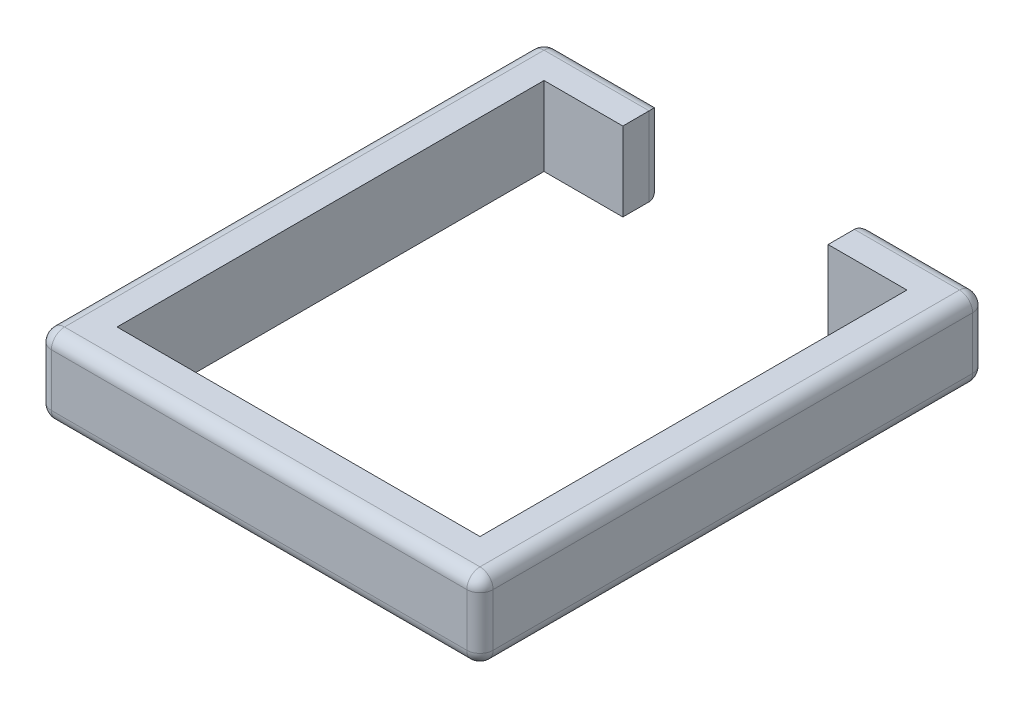
ISO-10303-21;
HEADER;
FILE_DESCRIPTION(('STEP AP214'),'2;1');
FILE_NAME('part.step','',(''),(''),'','','');
FILE_SCHEMA(('AUTOMOTIVE_DESIGN { 1 0 10303 214 1 1 1 1 }'));
ENDSEC;
DATA;
#1=APPLICATION_CONTEXT('core data for automotive mechanical design processes');
#2=APPLICATION_PROTOCOL_DEFINITION('international standard','automotive_design',2000,#1);
#3=PRODUCT_CONTEXT('',#1,'mechanical');
#4=PRODUCT('Part','Part','',(#3));
#5=PRODUCT_RELATED_PRODUCT_CATEGORY('part','',(#4));
#6=PRODUCT_DEFINITION_FORMATION('','',#4);
#7=PRODUCT_DEFINITION_CONTEXT('part definition',#1,'design');
#8=PRODUCT_DEFINITION('design','',#6,#7);
#9=PRODUCT_DEFINITION_SHAPE('','',#8);
#10=(LENGTH_UNIT() NAMED_UNIT(*) SI_UNIT(.MILLI.,.METRE.));
#11=(NAMED_UNIT(*) PLANE_ANGLE_UNIT() SI_UNIT($,.RADIAN.));
#12=(NAMED_UNIT(*) SI_UNIT($,.STERADIAN.) SOLID_ANGLE_UNIT());
#13=UNCERTAINTY_MEASURE_WITH_UNIT(LENGTH_MEASURE(1.E-05),#10,'distance_accuracy_value','');
#14=(GEOMETRIC_REPRESENTATION_CONTEXT(3) GLOBAL_UNCERTAINTY_ASSIGNED_CONTEXT((#13)) GLOBAL_UNIT_ASSIGNED_CONTEXT((#10,
#11,#12)) REPRESENTATION_CONTEXT('',''));
#15=CARTESIAN_POINT('',(0.,0.,0.));
#16=DIRECTION('',(0.,0.,1.));
#17=DIRECTION('',(1.,0.,0.));
#18=AXIS2_PLACEMENT_3D('',#15,#16,#17);
#19=CARTESIAN_POINT('',(228.6,152.4,76.2));
#20=DIRECTION('',(-1.,0.,0.));
#21=DIRECTION('',(0.,0.,1.));
#22=AXIS2_PLACEMENT_3D('',#19,#20,#21);
#23=PLANE('',#22);
#24=DIRECTION('',(0.,0.,-1.));
#25=VECTOR('',#24,1.);
#26=CARTESIAN_POINT('',(228.6,0.,76.2));
#27=LINE('',#26,#25);
#28=CARTESIAN_POINT('',(228.6,0.,76.2));
#29=VERTEX_POINT('',#28);
#30=CARTESIAN_POINT('',(228.6,0.,25.4));
#31=VERTEX_POINT('',#30);
#32=EDGE_CURVE('E221',#29,#31,#27,.T.);
#33=ORIENTED_EDGE('',*,*,#32,.T.);
#34=DIRECTION('',(0.,-1.,0.));
#35=VECTOR('',#34,1.);
#36=CARTESIAN_POINT('',(228.6,152.4,25.4));
#37=LINE('',#36,#35);
#38=CARTESIAN_POINT('',(228.6,152.4,25.4));
#39=VERTEX_POINT('',#38);
#40=EDGE_CURVE('E295',#31,#39,#37,.F.);
#41=ORIENTED_EDGE('',*,*,#40,.T.);
#42=DIRECTION('',(0.,0.,-1.));
#43=VECTOR('',#42,1.);
#44=CARTESIAN_POINT('',(228.6,152.4,76.2));
#45=LINE('',#44,#43);
#46=CARTESIAN_POINT('',(228.6,152.4,76.2));
#47=VERTEX_POINT('',#46);
#48=EDGE_CURVE('E194',#47,#39,#45,.T.);
#49=ORIENTED_EDGE('',*,*,#48,.F.);
#50=DIRECTION('',(0.,-1.,0.));
#51=VECTOR('',#50,1.);
#52=CARTESIAN_POINT('',(228.6,152.4,76.2));
#53=LINE('',#52,#51);
#54=EDGE_CURVE('E220',#47,#29,#53,.T.);
#55=ORIENTED_EDGE('',*,*,#54,.T.);
#56=EDGE_LOOP('',(#33,#41,#49,#55));
#57=FACE_BOUND('',#56,.T.);
#58=ADVANCED_FACE('F35',(#57),#23,.F.);
#59=CARTESIAN_POINT('',(228.6,152.4,0.));
#60=DIRECTION('',(0.,0.,1.));
#61=DIRECTION('',(1.,0.,0.));
#62=AXIS2_PLACEMENT_3D('',#59,#60,#61);
#63=PLANE('',#62);
#64=DIRECTION('',(-1.,0.,0.));
#65=VECTOR('',#64,1.);
#66=CARTESIAN_POINT('',(228.6,127.,0.));
#67=LINE('',#66,#65);
#68=CARTESIAN_POINT('',(25.4,127.,0.));
#69=VERTEX_POINT('',#68);
#70=CARTESIAN_POINT('',(203.2,127.,0.));
#71=VERTEX_POINT('',#70);
#72=EDGE_CURVE('E290',#69,#71,#67,.F.);
#73=ORIENTED_EDGE('',*,*,#72,.T.);
#74=DIRECTION('',(0.,-1.,0.));
#75=VECTOR('',#74,1.);
#76=CARTESIAN_POINT('',(203.2,152.4,0.));
#77=LINE('',#76,#75);
#78=CARTESIAN_POINT('',(203.2,25.4,0.));
#79=VERTEX_POINT('',#78);
#80=EDGE_CURVE('E292',#71,#79,#77,.T.);
#81=ORIENTED_EDGE('',*,*,#80,.T.);
#82=DIRECTION('',(-1.,0.,0.));
#83=VECTOR('',#82,1.);
#84=CARTESIAN_POINT('',(228.6,25.4,0.));
#85=LINE('',#84,#83);
#86=CARTESIAN_POINT('',(25.4,25.4,0.));
#87=VERTEX_POINT('',#86);
#88=EDGE_CURVE('E288',#79,#87,#85,.T.);
#89=ORIENTED_EDGE('',*,*,#88,.T.);
#90=DIRECTION('',(0.,-1.,0.));
#91=VECTOR('',#90,1.);
#92=CARTESIAN_POINT('',(25.4,152.4,0.));
#93=LINE('',#92,#91);
#94=EDGE_CURVE('E286',#87,#69,#93,.F.);
#95=ORIENTED_EDGE('',*,*,#94,.T.);
#96=EDGE_LOOP('',(#73,#81,#89,#95));
#97=FACE_BOUND('',#96,.T.);
#98=ADVANCED_FACE('F430',(#97),#63,.F.);
#99=CARTESIAN_POINT('',(0.,152.4,0.));
#100=DIRECTION('',(1.,0.,0.));
#101=DIRECTION('',(0.,0.,-1.));
#102=AXIS2_PLACEMENT_3D('',#99,#100,#101);
#103=PLANE('',#102);
#104=DIRECTION('',(0.,0.,1.));
#105=VECTOR('',#104,1.);
#106=CARTESIAN_POINT('',(0.,127.,0.));
#107=LINE('',#106,#105);
#108=CARTESIAN_POINT('',(1.16647607618785E-13,127.,952.5));
#109=VERTEX_POINT('',#108);
#110=CARTESIAN_POINT('',(0.,127.,25.4));
#111=VERTEX_POINT('',#110);
#112=EDGE_CURVE('E301',#109,#111,#107,.F.);
#113=ORIENTED_EDGE('',*,*,#112,.T.);
#114=DIRECTION('',(0.,-1.,0.));
#115=VECTOR('',#114,1.);
#116=CARTESIAN_POINT('',(0.,152.4,25.4));
#117=LINE('',#116,#115);
#118=CARTESIAN_POINT('',(0.,25.4,25.4));
#119=VERTEX_POINT('',#118);
#120=EDGE_CURVE('E303',#111,#119,#117,.T.);
#121=ORIENTED_EDGE('',*,*,#120,.T.);
#122=DIRECTION('',(0.,0.,1.));
#123=VECTOR('',#122,1.);
#124=CARTESIAN_POINT('',(0.,25.4,0.));
#125=LINE('',#124,#123);
#126=CARTESIAN_POINT('',(1.16647607618785E-13,25.4,952.5));
#127=VERTEX_POINT('',#126);
#128=EDGE_CURVE('E297',#119,#127,#125,.T.);
#129=ORIENTED_EDGE('',*,*,#128,.T.);
#130=DIRECTION('',(0.,-1.,0.));
#131=VECTOR('',#130,1.);
#132=CARTESIAN_POINT('',(1.16647607618785E-13,152.4,952.5));
#133=LINE('',#132,#131);
#134=EDGE_CURVE('E299',#127,#109,#133,.F.);
#135=ORIENTED_EDGE('',*,*,#134,.T.);
#136=EDGE_LOOP('',(#113,#121,#129,#135));
#137=FACE_BOUND('',#136,.T.);
#138=ADVANCED_FACE('F405',(#137),#103,.F.);
#139=CARTESIAN_POINT('',(1.1975821048862E-13,152.4,977.9));
#140=DIRECTION('',(0.,0.,-1.));
#141=DIRECTION('',(-1.,0.,0.));
#142=AXIS2_PLACEMENT_3D('',#139,#140,#141);
#143=PLANE('',#142);
#144=DIRECTION('',(1.,0.,0.));
#145=VECTOR('',#144,1.);
#146=CARTESIAN_POINT('',(1.1975821048862E-13,127.,977.9));
#147=LINE('',#146,#145);
#148=CARTESIAN_POINT('',(828.675,127.,977.9));
#149=VERTEX_POINT('',#148);
#150=CARTESIAN_POINT('',(25.4000000000001,127.,977.9));
#151=VERTEX_POINT('',#150);
#152=EDGE_CURVE('E260',#149,#151,#147,.F.);
#153=ORIENTED_EDGE('',*,*,#152,.T.);
#154=DIRECTION('',(0.,-1.,0.));
#155=VECTOR('',#154,1.);
#156=CARTESIAN_POINT('',(25.4000000000001,152.4,977.9));
#157=LINE('',#156,#155);
#158=CARTESIAN_POINT('',(25.4000000000001,25.4,977.9));
#159=VERTEX_POINT('',#158);
#160=EDGE_CURVE('E263',#151,#159,#157,.T.);
#161=ORIENTED_EDGE('',*,*,#160,.T.);
#162=DIRECTION('',(1.,0.,0.));
#163=VECTOR('',#162,1.);
#164=CARTESIAN_POINT('',(1.1975821048862E-13,25.4,977.9));
#165=LINE('',#164,#163);
#166=CARTESIAN_POINT('',(828.675,25.4,977.9));
#167=VERTEX_POINT('',#166);
#168=EDGE_CURVE('E258',#159,#167,#165,.T.);
#169=ORIENTED_EDGE('',*,*,#168,.T.);
#170=DIRECTION('',(0.,-1.,0.));
#171=VECTOR('',#170,1.);
#172=CARTESIAN_POINT('',(828.675,152.4,977.9));
#173=LINE('',#172,#171);
#174=EDGE_CURVE('E256',#167,#149,#173,.F.);
#175=ORIENTED_EDGE('',*,*,#174,.T.);
#176=EDGE_LOOP('',(#153,#161,#169,#175));
#177=FACE_BOUND('',#176,.T.);
#178=ADVANCED_FACE('F457',(#177),#143,.F.);
#179=CARTESIAN_POINT('',(854.075,152.4,977.9));
#180=DIRECTION('',(-1.,0.,0.));
#181=DIRECTION('',(0.,0.,1.));
#182=AXIS2_PLACEMENT_3D('',#179,#180,#181);
#183=PLANE('',#182);
#184=DIRECTION('',(0.,0.,-1.));
#185=VECTOR('',#184,1.);
#186=CARTESIAN_POINT('',(854.075,127.,977.9));
#187=LINE('',#186,#185);
#188=CARTESIAN_POINT('',(854.075,127.,25.4));
#189=VERTEX_POINT('',#188);
#190=CARTESIAN_POINT('',(854.075,127.,952.5));
#191=VERTEX_POINT('',#190);
#192=EDGE_CURVE('E44',#189,#191,#187,.F.);
#193=ORIENTED_EDGE('',*,*,#192,.T.);
#194=DIRECTION('',(0.,-1.,0.));
#195=VECTOR('',#194,1.);
#196=CARTESIAN_POINT('',(854.075,152.4,952.5));
#197=LINE('',#196,#195);
#198=CARTESIAN_POINT('',(854.075,25.4,952.5));
#199=VERTEX_POINT('',#198);
#200=EDGE_CURVE('E11',#191,#199,#197,.T.);
#201=ORIENTED_EDGE('',*,*,#200,.T.);
#202=DIRECTION('',(0.,0.,-1.));
#203=VECTOR('',#202,1.);
#204=CARTESIAN_POINT('',(854.075,25.4,977.9));
#205=LINE('',#204,#203);
#206=CARTESIAN_POINT('',(854.075,25.4,25.4));
#207=VERTEX_POINT('',#206);
#208=EDGE_CURVE('E306',#199,#207,#205,.T.);
#209=ORIENTED_EDGE('',*,*,#208,.T.);
#210=DIRECTION('',(0.,-1.,0.));
#211=VECTOR('',#210,1.);
#212=CARTESIAN_POINT('',(854.075,152.4,25.4));
#213=LINE('',#212,#211);
#214=EDGE_CURVE('E55',#207,#189,#213,.F.);
#215=ORIENTED_EDGE('',*,*,#214,.T.);
#216=EDGE_LOOP('',(#193,#201,#209,#215));
#217=FACE_BOUND('',#216,.T.);
#218=ADVANCED_FACE('F763',(#217),#183,.F.);
#219=CARTESIAN_POINT('',(854.075,152.4,0.));
#220=DIRECTION('',(0.,0.,1.));
#221=DIRECTION('',(1.,0.,0.));
#222=AXIS2_PLACEMENT_3D('',#219,#220,#221);
#223=PLANE('',#222);
#224=DIRECTION('',(0.,-1.,0.));
#225=VECTOR('',#224,1.);
#226=CARTESIAN_POINT('',(650.875,152.4,0.));
#227=LINE('',#226,#225);
#228=CARTESIAN_POINT('',(650.875,25.4,0.));
#229=VERTEX_POINT('',#228);
#230=CARTESIAN_POINT('',(650.875,127.,0.));
#231=VERTEX_POINT('',#230);
#232=EDGE_CURVE('E279',#229,#231,#227,.F.);
#233=ORIENTED_EDGE('',*,*,#232,.T.);
#234=DIRECTION('',(-1.,0.,0.));
#235=VECTOR('',#234,1.);
#236=CARTESIAN_POINT('',(854.075,127.,0.));
#237=LINE('',#236,#235);
#238=CARTESIAN_POINT('',(828.675,127.,0.));
#239=VERTEX_POINT('',#238);
#240=EDGE_CURVE('E281',#231,#239,#237,.F.);
#241=ORIENTED_EDGE('',*,*,#240,.T.);
#242=DIRECTION('',(0.,-1.,0.));
#243=VECTOR('',#242,1.);
#244=CARTESIAN_POINT('',(828.675,152.4,0.));
#245=LINE('',#244,#243);
#246=CARTESIAN_POINT('',(828.675,25.4,0.));
#247=VERTEX_POINT('',#246);
#248=EDGE_CURVE('E275',#239,#247,#245,.T.);
#249=ORIENTED_EDGE('',*,*,#248,.T.);
#250=DIRECTION('',(-1.,0.,0.));
#251=VECTOR('',#250,1.);
#252=CARTESIAN_POINT('',(854.075,25.4,0.));
#253=LINE('',#252,#251);
#254=EDGE_CURVE('E277',#247,#229,#253,.T.);
#255=ORIENTED_EDGE('',*,*,#254,.T.);
#256=EDGE_LOOP('',(#233,#241,#249,#255));
#257=FACE_BOUND('',#256,.T.);
#258=ADVANCED_FACE('F488',(#257),#223,.F.);
#259=CARTESIAN_POINT('',(625.475,152.4,0.));
#260=DIRECTION('',(1.,0.,0.));
#261=DIRECTION('',(0.,0.,-1.));
#262=AXIS2_PLACEMENT_3D('',#259,#260,#261);
#263=PLANE('',#262);
#264=DIRECTION('',(0.,0.,1.));
#265=VECTOR('',#264,1.);
#266=CARTESIAN_POINT('',(625.475,152.4,0.));
#267=LINE('',#266,#265);
#268=CARTESIAN_POINT('',(625.475,152.4,25.4));
#269=VERTEX_POINT('',#268);
#270=CARTESIAN_POINT('',(625.475,152.4,76.2));
#271=VERTEX_POINT('',#270);
#272=EDGE_CURVE('E183',#269,#271,#267,.T.);
#273=ORIENTED_EDGE('',*,*,#272,.F.);
#274=DIRECTION('',(0.,-1.,0.));
#275=VECTOR('',#274,1.);
#276=CARTESIAN_POINT('',(625.475,152.4,25.4));
#277=LINE('',#276,#275);
#278=CARTESIAN_POINT('',(625.475,0.,25.4));
#279=VERTEX_POINT('',#278);
#280=EDGE_CURVE('E284',#269,#279,#277,.T.);
#281=ORIENTED_EDGE('',*,*,#280,.T.);
#282=DIRECTION('',(0.,0.,1.));
#283=VECTOR('',#282,1.);
#284=CARTESIAN_POINT('',(625.475,0.,0.));
#285=LINE('',#284,#283);
#286=CARTESIAN_POINT('',(625.475,0.,76.2));
#287=VERTEX_POINT('',#286);
#288=EDGE_CURVE('E200',#279,#287,#285,.T.);
#289=ORIENTED_EDGE('',*,*,#288,.T.);
#290=DIRECTION('',(0.,-1.,0.));
#291=VECTOR('',#290,1.);
#292=CARTESIAN_POINT('',(625.475,152.4,76.2));
#293=LINE('',#292,#291);
#294=EDGE_CURVE('E197',#271,#287,#293,.T.);
#295=ORIENTED_EDGE('',*,*,#294,.F.);
#296=EDGE_LOOP('',(#273,#281,#289,#295));
#297=FACE_BOUND('',#296,.T.);
#298=ADVANCED_FACE('F198',(#297),#263,.F.);
#299=CARTESIAN_POINT('',(625.475,152.4,76.2));
#300=DIRECTION('',(0.,0.,-1.));
#301=DIRECTION('',(-1.,0.,0.));
#302=AXIS2_PLACEMENT_3D('',#299,#300,#301);
#303=PLANE('',#302);
#304=DIRECTION('',(1.,0.,0.));
#305=VECTOR('',#304,1.);
#306=CARTESIAN_POINT('',(625.475,0.,76.2));
#307=LINE('',#306,#305);
#308=CARTESIAN_POINT('',(777.875,0.,76.2));
#309=VERTEX_POINT('',#308);
#310=EDGE_CURVE('E225',#287,#309,#307,.T.);
#311=ORIENTED_EDGE('',*,*,#310,.T.);
#312=DIRECTION('',(0.,-1.,0.));
#313=VECTOR('',#312,1.);
#314=CARTESIAN_POINT('',(777.875,152.4,76.2));
#315=LINE('',#314,#313);
#316=CARTESIAN_POINT('',(777.875,152.4,76.2));
#317=VERTEX_POINT('',#316);
#318=EDGE_CURVE('E204',#317,#309,#315,.T.);
#319=ORIENTED_EDGE('',*,*,#318,.F.);
#320=DIRECTION('',(1.,0.,0.));
#321=VECTOR('',#320,1.);
#322=CARTESIAN_POINT('',(625.475,152.4,76.2));
#323=LINE('',#322,#321);
#324=EDGE_CURVE('E188',#271,#317,#323,.T.);
#325=ORIENTED_EDGE('',*,*,#324,.F.);
#326=ORIENTED_EDGE('',*,*,#294,.T.);
#327=EDGE_LOOP('',(#311,#319,#325,#326));
#328=FACE_BOUND('',#327,.T.);
#329=ADVANCED_FACE('F206',(#328),#303,.F.);
#330=CARTESIAN_POINT('',(777.875,152.4,76.2));
#331=DIRECTION('',(1.,0.,0.));
#332=DIRECTION('',(0.,0.,-1.));
#333=AXIS2_PLACEMENT_3D('',#330,#331,#332);
#334=PLANE('',#333);
#335=DIRECTION('',(0.,0.,1.));
#336=VECTOR('',#335,1.);
#337=CARTESIAN_POINT('',(777.875,0.,76.2));
#338=LINE('',#337,#336);
#339=CARTESIAN_POINT('',(777.875,0.,901.7));
#340=VERTEX_POINT('',#339);
#341=EDGE_CURVE('E227',#309,#340,#338,.T.);
#342=ORIENTED_EDGE('',*,*,#341,.T.);
#343=DIRECTION('',(0.,-1.,0.));
#344=VECTOR('',#343,1.);
#345=CARTESIAN_POINT('',(777.875,152.4,901.7));
#346=LINE('',#345,#344);
#347=CARTESIAN_POINT('',(777.875,152.4,901.7));
#348=VERTEX_POINT('',#347);
#349=EDGE_CURVE('E243',#348,#340,#346,.T.);
#350=ORIENTED_EDGE('',*,*,#349,.F.);
#351=DIRECTION('',(0.,0.,1.));
#352=VECTOR('',#351,1.);
#353=CARTESIAN_POINT('',(777.875,152.4,76.2));
#354=LINE('',#353,#352);
#355=EDGE_CURVE('E209',#317,#348,#354,.T.);
#356=ORIENTED_EDGE('',*,*,#355,.F.);
#357=ORIENTED_EDGE('',*,*,#318,.T.);
#358=EDGE_LOOP('',(#342,#350,#356,#357));
#359=FACE_BOUND('',#358,.T.);
#360=ADVANCED_FACE('F733',(#359),#334,.F.);
#361=CARTESIAN_POINT('',(777.875,152.4,901.7));
#362=DIRECTION('',(0.,0.,1.));
#363=DIRECTION('',(1.,0.,0.));
#364=AXIS2_PLACEMENT_3D('',#361,#362,#363);
#365=PLANE('',#364);
#366=DIRECTION('',(-1.,0.,0.));
#367=VECTOR('',#366,1.);
#368=CARTESIAN_POINT('',(777.875,0.,901.7));
#369=LINE('',#368,#367);
#370=CARTESIAN_POINT('',(76.2,0.,901.7));
#371=VERTEX_POINT('',#370);
#372=EDGE_CURVE('E229',#340,#371,#369,.T.);
#373=ORIENTED_EDGE('',*,*,#372,.T.);
#374=DIRECTION('',(0.,-1.,0.));
#375=VECTOR('',#374,1.);
#376=CARTESIAN_POINT('',(76.2,152.4,901.7));
#377=LINE('',#376,#375);
#378=CARTESIAN_POINT('',(76.2,152.4,901.7));
#379=VERTEX_POINT('',#378);
#380=EDGE_CURVE('E240',#379,#371,#377,.T.);
#381=ORIENTED_EDGE('',*,*,#380,.F.);
#382=DIRECTION('',(-1.,0.,0.));
#383=VECTOR('',#382,1.);
#384=CARTESIAN_POINT('',(777.875,152.4,901.7));
#385=LINE('',#384,#383);
#386=EDGE_CURVE('E211',#348,#379,#385,.T.);
#387=ORIENTED_EDGE('',*,*,#386,.F.);
#388=ORIENTED_EDGE('',*,*,#349,.T.);
#389=EDGE_LOOP('',(#373,#381,#387,#388));
#390=FACE_BOUND('',#389,.T.);
#391=ADVANCED_FACE('F724',(#390),#365,.F.);
#392=CARTESIAN_POINT('',(76.2,152.4,901.7));
#393=DIRECTION('',(-1.,0.,0.));
#394=DIRECTION('',(0.,0.,1.));
#395=AXIS2_PLACEMENT_3D('',#392,#393,#394);
#396=PLANE('',#395);
#397=DIRECTION('',(0.,0.,-1.));
#398=VECTOR('',#397,1.);
#399=CARTESIAN_POINT('',(76.2,0.,901.7));
#400=LINE('',#399,#398);
#401=CARTESIAN_POINT('',(76.2,0.,76.2));
#402=VERTEX_POINT('',#401);
#403=EDGE_CURVE('E231',#371,#402,#400,.T.);
#404=ORIENTED_EDGE('',*,*,#403,.T.);
#405=DIRECTION('',(0.,-1.,0.));
#406=VECTOR('',#405,1.);
#407=CARTESIAN_POINT('',(76.2,152.4,76.2));
#408=LINE('',#407,#406);
#409=CARTESIAN_POINT('',(76.2,152.4,76.2));
#410=VERTEX_POINT('',#409);
#411=EDGE_CURVE('E237',#410,#402,#408,.T.);
#412=ORIENTED_EDGE('',*,*,#411,.F.);
#413=DIRECTION('',(0.,0.,-1.));
#414=VECTOR('',#413,1.);
#415=CARTESIAN_POINT('',(76.2,152.4,901.7));
#416=LINE('',#415,#414);
#417=EDGE_CURVE('E216',#379,#410,#416,.T.);
#418=ORIENTED_EDGE('',*,*,#417,.F.);
#419=ORIENTED_EDGE('',*,*,#380,.T.);
#420=EDGE_LOOP('',(#404,#412,#418,#419));
#421=FACE_BOUND('',#420,.T.);
#422=ADVANCED_FACE('F715',(#421),#396,.F.);
#423=CARTESIAN_POINT('',(76.2,152.4,76.2));
#424=DIRECTION('',(0.,0.,-1.));
#425=DIRECTION('',(-1.,0.,0.));
#426=AXIS2_PLACEMENT_3D('',#423,#424,#425);
#427=PLANE('',#426);
#428=DIRECTION('',(1.,0.,0.));
#429=VECTOR('',#428,1.);
#430=CARTESIAN_POINT('',(76.2,0.,76.2));
#431=LINE('',#430,#429);
#432=EDGE_CURVE('E233',#402,#29,#431,.T.);
#433=ORIENTED_EDGE('',*,*,#432,.T.);
#434=ORIENTED_EDGE('',*,*,#54,.F.);
#435=DIRECTION('',(1.,0.,0.));
#436=VECTOR('',#435,1.);
#437=CARTESIAN_POINT('',(76.2,152.4,76.2));
#438=LINE('',#437,#436);
#439=EDGE_CURVE('E218',#410,#47,#438,.T.);
#440=ORIENTED_EDGE('',*,*,#439,.F.);
#441=ORIENTED_EDGE('',*,*,#411,.T.);
#442=EDGE_LOOP('',(#433,#434,#440,#441));
#443=FACE_BOUND('',#442,.T.);
#444=ADVANCED_FACE('F706',(#443),#427,.F.);
#445=CARTESIAN_POINT('',(0.,152.4,0.));
#446=DIRECTION('',(0.,1.,0.));
#447=DIRECTION('',(0.,0.,1.));
#448=AXIS2_PLACEMENT_3D('',#445,#446,#447);
#449=PLANE('',#448);
#450=ORIENTED_EDGE('',*,*,#48,.T.);
#451=DIRECTION('',(-1.,0.,0.));
#452=VECTOR('',#451,1.);
#453=CARTESIAN_POINT('',(0.,152.4,25.4));
#454=LINE('',#453,#452);
#455=CARTESIAN_POINT('',(25.4,152.4,25.4));
#456=VERTEX_POINT('',#455);
#457=EDGE_CURVE('E254',#39,#456,#454,.T.);
#458=ORIENTED_EDGE('',*,*,#457,.T.);
#459=DIRECTION('',(0.,0.,1.));
#460=VECTOR('',#459,1.);
#461=CARTESIAN_POINT('',(25.4000000000001,152.4,977.9));
#462=LINE('',#461,#460);
#463=CARTESIAN_POINT('',(25.4000000000001,152.4,952.5));
#464=VERTEX_POINT('',#463);
#465=EDGE_CURVE('E252',#456,#464,#462,.T.);
#466=ORIENTED_EDGE('',*,*,#465,.T.);
#467=DIRECTION('',(1.,0.,0.));
#468=VECTOR('',#467,1.);
#469=CARTESIAN_POINT('',(854.075,152.4,952.5));
#470=LINE('',#469,#468);
#471=CARTESIAN_POINT('',(828.675,152.4,952.5));
#472=VERTEX_POINT('',#471);
#473=EDGE_CURVE('E249',#464,#472,#470,.T.);
#474=ORIENTED_EDGE('',*,*,#473,.T.);
#475=DIRECTION('',(0.,0.,-1.));
#476=VECTOR('',#475,1.);
#477=CARTESIAN_POINT('',(828.675,152.4,0.));
#478=LINE('',#477,#476);
#479=CARTESIAN_POINT('',(828.675,152.4,25.4));
#480=VERTEX_POINT('',#479);
#481=EDGE_CURVE('E203',#472,#480,#478,.T.);
#482=ORIENTED_EDGE('',*,*,#481,.T.);
#483=DIRECTION('',(-1.,0.,0.));
#484=VECTOR('',#483,1.);
#485=CARTESIAN_POINT('',(625.475,152.4,25.4));
#486=LINE('',#485,#484);
#487=EDGE_CURVE('E191',#480,#269,#486,.T.);
#488=ORIENTED_EDGE('',*,*,#487,.T.);
#489=ORIENTED_EDGE('',*,*,#272,.T.);
#490=ORIENTED_EDGE('',*,*,#324,.T.);
#491=ORIENTED_EDGE('',*,*,#355,.T.);
#492=ORIENTED_EDGE('',*,*,#386,.T.);
#493=ORIENTED_EDGE('',*,*,#417,.T.);
#494=ORIENTED_EDGE('',*,*,#439,.T.);
#495=EDGE_LOOP('',(#450,#458,#466,#474,#482,#488,#489,#490,#491,#492,#493,#494));
#496=FACE_BOUND('',#495,.T.);
#497=ADVANCED_FACE('F186',(#496),#449,.T.);
#498=CARTESIAN_POINT('',(0.,0.,0.));
#499=DIRECTION('',(0.,1.,0.));
#500=DIRECTION('',(0.,0.,1.));
#501=AXIS2_PLACEMENT_3D('',#498,#499,#500);
#502=PLANE('',#501);
#503=DIRECTION('',(0.,0.,1.));
#504=VECTOR('',#503,1.);
#505=CARTESIAN_POINT('',(25.4,0.,0.));
#506=LINE('',#505,#504);
#507=CARTESIAN_POINT('',(25.4000000000001,0.,952.5));
#508=VERTEX_POINT('',#507);
#509=CARTESIAN_POINT('',(25.4,0.,25.4));
#510=VERTEX_POINT('',#509);
#511=EDGE_CURVE('E271',#508,#510,#506,.F.);
#512=ORIENTED_EDGE('',*,*,#511,.T.);
#513=DIRECTION('',(-1.,0.,0.));
#514=VECTOR('',#513,1.);
#515=CARTESIAN_POINT('',(0.,0.,25.4));
#516=LINE('',#515,#514);
#517=EDGE_CURVE('E273',#510,#31,#516,.F.);
#518=ORIENTED_EDGE('',*,*,#517,.T.);
#519=ORIENTED_EDGE('',*,*,#32,.F.);
#520=ORIENTED_EDGE('',*,*,#432,.F.);
#521=ORIENTED_EDGE('',*,*,#403,.F.);
#522=ORIENTED_EDGE('',*,*,#372,.F.);
#523=ORIENTED_EDGE('',*,*,#341,.F.);
#524=ORIENTED_EDGE('',*,*,#310,.F.);
#525=ORIENTED_EDGE('',*,*,#288,.F.);
#526=DIRECTION('',(-1.,0.,0.));
#527=VECTOR('',#526,1.);
#528=CARTESIAN_POINT('',(0.,0.,25.4000000000001));
#529=LINE('',#528,#527);
#530=CARTESIAN_POINT('',(828.675,0.,25.4));
#531=VERTEX_POINT('',#530);
#532=EDGE_CURVE('E267',#279,#531,#529,.F.);
#533=ORIENTED_EDGE('',*,*,#532,.T.);
#534=DIRECTION('',(0.,0.,-1.));
#535=VECTOR('',#534,1.);
#536=CARTESIAN_POINT('',(828.675,0.,0.));
#537=LINE('',#536,#535);
#538=CARTESIAN_POINT('',(828.675,0.,952.5));
#539=VERTEX_POINT('',#538);
#540=EDGE_CURVE('E265',#531,#539,#537,.F.);
#541=ORIENTED_EDGE('',*,*,#540,.T.);
#542=DIRECTION('',(1.,0.,0.));
#543=VECTOR('',#542,1.);
#544=CARTESIAN_POINT('',(0.,0.,952.5));
#545=LINE('',#544,#543);
#546=EDGE_CURVE('E269',#539,#508,#545,.F.);
#547=ORIENTED_EDGE('',*,*,#546,.T.);
#548=EDGE_LOOP('',(#512,#518,#519,#520,#521,#522,#523,#524,#525,#533,#541,#547));
#549=FACE_BOUND('',#548,.T.);
#550=ADVANCED_FACE('F437',(#549),#502,.F.);
#551=CARTESIAN_POINT('',(228.6,25.4,25.4));
#552=DIRECTION('',(-1.,0.,0.));
#553=DIRECTION('',(0.,0.,1.));
#554=AXIS2_PLACEMENT_3D('',#551,#552,#553);
#555=CYLINDRICAL_SURFACE('',#554,25.4);
#556=CARTESIAN_POINT('',(203.2,25.4,25.4));
#557=DIRECTION('',(-0.707106781186547,-0.707106781186547,0.));
#558=DIRECTION('',(-0.707106781186547,0.707106781186547,0.));
#559=AXIS2_PLACEMENT_3D('',#556,#557,#558);
#560=ELLIPSE('',#559,35.9210244842766,25.4);
#561=EDGE_CURVE('E383',#31,#79,#560,.F.);
#562=ORIENTED_EDGE('',*,*,#561,.F.);
#563=ORIENTED_EDGE('',*,*,#517,.F.);
#564=CARTESIAN_POINT('',(25.4,25.4,25.4));
#565=DIRECTION('',(-1.,0.,0.));
#566=DIRECTION('',(0.,0.,1.));
#567=AXIS2_PLACEMENT_3D('',#564,#565,#566);
#568=CIRCLE('',#567,25.4);
#569=EDGE_CURVE('E39',#87,#510,#568,.T.);
#570=ORIENTED_EDGE('',*,*,#569,.F.);
#571=ORIENTED_EDGE('',*,*,#88,.F.);
#572=EDGE_LOOP('',(#562,#563,#570,#571));
#573=FACE_BOUND('',#572,.T.);
#574=ADVANCED_FACE('F37',(#573),#555,.T.);
#575=CARTESIAN_POINT('',(854.075,25.4,25.4));
#576=DIRECTION('',(-1.,0.,0.));
#577=DIRECTION('',(0.,0.,1.));
#578=AXIS2_PLACEMENT_3D('',#575,#576,#577);
#579=CYLINDRICAL_SURFACE('',#578,25.4);
#580=CARTESIAN_POINT('',(828.675,25.4,25.4));
#581=DIRECTION('',(1.,0.,0.));
#582=DIRECTION('',(0.,0.,-1.));
#583=AXIS2_PLACEMENT_3D('',#580,#581,#582);
#584=CIRCLE('',#583,25.4);
#585=EDGE_CURVE('E378',#531,#247,#584,.T.);
#586=ORIENTED_EDGE('',*,*,#585,.F.);
#587=ORIENTED_EDGE('',*,*,#532,.F.);
#588=CARTESIAN_POINT('',(650.875,25.4,25.4));
#589=DIRECTION('',(-0.707106781186547,0.707106781186547,0.));
#590=DIRECTION('',(-0.707106781186547,-0.707106781186547,0.));
#591=AXIS2_PLACEMENT_3D('',#588,#589,#590);
#592=ELLIPSE('',#591,35.9210244842766,25.4);
#593=EDGE_CURVE('E381',#229,#279,#592,.T.);
#594=ORIENTED_EDGE('',*,*,#593,.F.);
#595=ORIENTED_EDGE('',*,*,#254,.F.);
#596=EDGE_LOOP('',(#586,#587,#594,#595));
#597=FACE_BOUND('',#596,.T.);
#598=ADVANCED_FACE('F497',(#597),#579,.T.);
#599=CARTESIAN_POINT('',(25.4,25.4,25.4));
#600=DIRECTION('',(0.,0.,1.));
#601=DIRECTION('',(1.,0.,0.));
#602=AXIS2_PLACEMENT_3D('',#599,#600,#601);
#603=SPHERICAL_SURFACE('',#602,25.4);
#604=CARTESIAN_POINT('',(25.4,25.4,25.4));
#605=DIRECTION('',(0.,-1.,0.));
#606=DIRECTION('',(0.,0.,-1.));
#607=AXIS2_PLACEMENT_3D('',#604,#605,#606);
#608=CIRCLE('',#607,25.4);
#609=EDGE_CURVE('E372',#87,#119,#608,.F.);
#610=ORIENTED_EDGE('',*,*,#609,.F.);
#611=ORIENTED_EDGE('',*,*,#569,.T.);
#612=CARTESIAN_POINT('',(25.4,25.4,25.4));
#613=DIRECTION('',(0.,0.,-1.));
#614=DIRECTION('',(-1.,0.,0.));
#615=AXIS2_PLACEMENT_3D('',#612,#613,#614);
#616=CIRCLE('',#615,25.4);
#617=EDGE_CURVE('E375',#119,#510,#616,.F.);
#618=ORIENTED_EDGE('',*,*,#617,.F.);
#619=EDGE_LOOP('',(#610,#611,#618));
#620=FACE_BOUND('',#619,.T.);
#621=ADVANCED_FACE('F394',(#620),#603,.T.);
#622=CARTESIAN_POINT('',(203.2,152.4,25.4));
#623=DIRECTION('',(0.,-1.,0.));
#624=DIRECTION('',(0.,0.,-1.));
#625=AXIS2_PLACEMENT_3D('',#622,#623,#624);
#626=CYLINDRICAL_SURFACE('',#625,25.4);
#627=ORIENTED_EDGE('',*,*,#561,.T.);
#628=ORIENTED_EDGE('',*,*,#80,.F.);
#629=CARTESIAN_POINT('',(203.2,127.,25.4));
#630=DIRECTION('',(0.707106781186547,-0.707106781186547,0.));
#631=DIRECTION('',(0.707106781186547,0.707106781186547,0.));
#632=AXIS2_PLACEMENT_3D('',#629,#630,#631);
#633=ELLIPSE('',#632,35.9210244842766,25.4);
#634=EDGE_CURVE('E369',#39,#71,#633,.F.);
#635=ORIENTED_EDGE('',*,*,#634,.F.);
#636=ORIENTED_EDGE('',*,*,#40,.F.);
#637=EDGE_LOOP('',(#627,#628,#635,#636));
#638=FACE_BOUND('',#637,.T.);
#639=ADVANCED_FACE('F431',(#638),#626,.T.);
#640=CARTESIAN_POINT('',(650.875,152.4,25.4));
#641=DIRECTION('',(0.,-1.,0.));
#642=DIRECTION('',(0.,0.,-1.));
#643=AXIS2_PLACEMENT_3D('',#640,#641,#642);
#644=CYLINDRICAL_SURFACE('',#643,25.4);
#645=ORIENTED_EDGE('',*,*,#593,.T.);
#646=ORIENTED_EDGE('',*,*,#280,.F.);
#647=CARTESIAN_POINT('',(650.875,127.,25.4));
#648=DIRECTION('',(-0.707106781186547,-0.707106781186547,0.));
#649=DIRECTION('',(0.707106781186547,-0.707106781186547,0.));
#650=AXIS2_PLACEMENT_3D('',#647,#648,#649);
#651=ELLIPSE('',#650,35.9210244842766,25.4);
#652=EDGE_CURVE('E366',#231,#269,#651,.F.);
#653=ORIENTED_EDGE('',*,*,#652,.F.);
#654=ORIENTED_EDGE('',*,*,#232,.F.);
#655=EDGE_LOOP('',(#645,#646,#653,#654));
#656=FACE_BOUND('',#655,.T.);
#657=ADVANCED_FACE('F492',(#656),#644,.T.);
#658=CARTESIAN_POINT('',(828.675,25.4,25.4));
#659=DIRECTION('',(0.,0.,1.));
#660=DIRECTION('',(1.,0.,0.));
#661=AXIS2_PLACEMENT_3D('',#658,#659,#660);
#662=SPHERICAL_SURFACE('',#661,25.4);
#663=CARTESIAN_POINT('',(828.675,25.4,25.4));
#664=DIRECTION('',(0.,0.,-1.));
#665=DIRECTION('',(-1.,0.,0.));
#666=AXIS2_PLACEMENT_3D('',#663,#664,#665);
#667=CIRCLE('',#666,25.4);
#668=EDGE_CURVE('E360',#531,#207,#667,.F.);
#669=ORIENTED_EDGE('',*,*,#668,.F.);
#670=ORIENTED_EDGE('',*,*,#585,.T.);
#671=CARTESIAN_POINT('',(828.675,25.4,25.4));
#672=DIRECTION('',(0.,-1.,0.));
#673=DIRECTION('',(0.,0.,-1.));
#674=AXIS2_PLACEMENT_3D('',#671,#672,#673);
#675=CIRCLE('',#674,25.4);
#676=EDGE_CURVE('E363',#207,#247,#675,.F.);
#677=ORIENTED_EDGE('',*,*,#676,.F.);
#678=EDGE_LOOP('',(#669,#670,#677));
#679=FACE_BOUND('',#678,.T.);
#680=ADVANCED_FACE('F500',(#679),#662,.T.);
#681=CARTESIAN_POINT('',(25.4,25.4,0.));
#682=DIRECTION('',(0.,0.,1.));
#683=DIRECTION('',(1.,0.,0.));
#684=AXIS2_PLACEMENT_3D('',#681,#682,#683);
#685=CYLINDRICAL_SURFACE('',#684,25.4);
#686=ORIENTED_EDGE('',*,*,#617,.T.);
#687=ORIENTED_EDGE('',*,*,#511,.F.);
#688=CARTESIAN_POINT('',(25.4000000000001,25.4,952.5));
#689=DIRECTION('',(0.,0.,1.));
#690=DIRECTION('',(1.,0.,0.));
#691=AXIS2_PLACEMENT_3D('',#688,#689,#690);
#692=CIRCLE('',#691,25.4);
#693=EDGE_CURVE('E354',#127,#508,#692,.T.);
#694=ORIENTED_EDGE('',*,*,#693,.F.);
#695=ORIENTED_EDGE('',*,*,#128,.F.);
#696=EDGE_LOOP('',(#686,#687,#694,#695));
#697=FACE_BOUND('',#696,.T.);
#698=ADVANCED_FACE('F400',(#697),#685,.T.);
#699=CARTESIAN_POINT('',(25.4,152.4,25.4));
#700=DIRECTION('',(0.,-1.,0.));
#701=DIRECTION('',(0.,0.,-1.));
#702=AXIS2_PLACEMENT_3D('',#699,#700,#701);
#703=CYLINDRICAL_SURFACE('',#702,25.4);
#704=ORIENTED_EDGE('',*,*,#609,.T.);
#705=ORIENTED_EDGE('',*,*,#120,.F.);
#706=CARTESIAN_POINT('',(25.4,127.,25.4));
#707=DIRECTION('',(0.,1.,0.));
#708=DIRECTION('',(0.,0.,1.));
#709=AXIS2_PLACEMENT_3D('',#706,#707,#708);
#710=CIRCLE('',#709,25.4);
#711=EDGE_CURVE('E351',#69,#111,#710,.T.);
#712=ORIENTED_EDGE('',*,*,#711,.F.);
#713=ORIENTED_EDGE('',*,*,#94,.F.);
#714=EDGE_LOOP('',(#704,#705,#712,#713));
#715=FACE_BOUND('',#714,.T.);
#716=ADVANCED_FACE('F411',(#715),#703,.T.);
#717=CARTESIAN_POINT('',(0.,127.,25.4));
#718=DIRECTION('',(1.,0.,0.));
#719=DIRECTION('',(0.,0.,-1.));
#720=AXIS2_PLACEMENT_3D('',#717,#718,#719);
#721=CYLINDRICAL_SURFACE('',#720,25.4);
#722=ORIENTED_EDGE('',*,*,#634,.T.);
#723=ORIENTED_EDGE('',*,*,#72,.F.);
#724=CARTESIAN_POINT('',(25.4,127.,25.4));
#725=DIRECTION('',(-1.,0.,0.));
#726=DIRECTION('',(0.,0.,1.));
#727=AXIS2_PLACEMENT_3D('',#724,#725,#726);
#728=CIRCLE('',#727,25.4);
#729=EDGE_CURVE('E348',#456,#69,#728,.T.);
#730=ORIENTED_EDGE('',*,*,#729,.F.);
#731=ORIENTED_EDGE('',*,*,#457,.F.);
#732=EDGE_LOOP('',(#722,#723,#730,#731));
#733=FACE_BOUND('',#732,.T.);
#734=ADVANCED_FACE('F428',(#733),#721,.T.);
#735=CARTESIAN_POINT('',(0.,127.,25.4000000000001));
#736=DIRECTION('',(1.,0.,0.));
#737=DIRECTION('',(0.,0.,-1.));
#738=AXIS2_PLACEMENT_3D('',#735,#736,#737);
#739=CYLINDRICAL_SURFACE('',#738,25.4);
#740=ORIENTED_EDGE('',*,*,#652,.T.);
#741=ORIENTED_EDGE('',*,*,#487,.F.);
#742=CARTESIAN_POINT('',(828.675,127.,25.4));
#743=DIRECTION('',(1.,0.,0.));
#744=DIRECTION('',(0.,0.,-1.));
#745=AXIS2_PLACEMENT_3D('',#742,#743,#744);
#746=CIRCLE('',#745,25.4);
#747=EDGE_CURVE('E345',#239,#480,#746,.T.);
#748=ORIENTED_EDGE('',*,*,#747,.F.);
#749=ORIENTED_EDGE('',*,*,#240,.F.);
#750=EDGE_LOOP('',(#740,#741,#748,#749));
#751=FACE_BOUND('',#750,.T.);
#752=ADVANCED_FACE('F477',(#751),#739,.T.);
#753=CARTESIAN_POINT('',(828.675,152.4,25.4));
#754=DIRECTION('',(0.,-1.,0.));
#755=DIRECTION('',(0.,0.,-1.));
#756=AXIS2_PLACEMENT_3D('',#753,#754,#755);
#757=CYLINDRICAL_SURFACE('',#756,25.4);
#758=ORIENTED_EDGE('',*,*,#676,.T.);
#759=ORIENTED_EDGE('',*,*,#248,.F.);
#760=CARTESIAN_POINT('',(828.675,127.,25.4));
#761=DIRECTION('',(0.,1.,0.));
#762=DIRECTION('',(0.,0.,1.));
#763=AXIS2_PLACEMENT_3D('',#760,#761,#762);
#764=CIRCLE('',#763,25.4);
#765=EDGE_CURVE('E343',#189,#239,#764,.T.);
#766=ORIENTED_EDGE('',*,*,#765,.F.);
#767=ORIENTED_EDGE('',*,*,#214,.F.);
#768=EDGE_LOOP('',(#758,#759,#766,#767));
#769=FACE_BOUND('',#768,.T.);
#770=ADVANCED_FACE('F484',(#769),#757,.T.);
#771=CARTESIAN_POINT('',(828.675,25.4,977.9));
#772=DIRECTION('',(0.,0.,-1.));
#773=DIRECTION('',(-1.,0.,0.));
#774=AXIS2_PLACEMENT_3D('',#771,#772,#773);
#775=CYLINDRICAL_SURFACE('',#774,25.4);
#776=ORIENTED_EDGE('',*,*,#668,.T.);
#777=ORIENTED_EDGE('',*,*,#208,.F.);
#778=CARTESIAN_POINT('',(828.675,25.4,952.5));
#779=DIRECTION('',(0.,0.,1.));
#780=DIRECTION('',(1.,0.,0.));
#781=AXIS2_PLACEMENT_3D('',#778,#779,#780);
#782=CIRCLE('',#781,25.4);
#783=EDGE_CURVE('E340',#539,#199,#782,.T.);
#784=ORIENTED_EDGE('',*,*,#783,.F.);
#785=ORIENTED_EDGE('',*,*,#540,.F.);
#786=EDGE_LOOP('',(#776,#777,#784,#785));
#787=FACE_BOUND('',#786,.T.);
#788=ADVANCED_FACE('F448',(#787),#775,.T.);
#789=CARTESIAN_POINT('',(1.1975821048862E-13,25.4,952.5));
#790=DIRECTION('',(1.,0.,0.));
#791=DIRECTION('',(0.,0.,-1.));
#792=AXIS2_PLACEMENT_3D('',#789,#790,#791);
#793=CYLINDRICAL_SURFACE('',#792,25.4);
#794=CARTESIAN_POINT('',(25.4000000000001,25.4,952.5));
#795=DIRECTION('',(-1.,0.,0.));
#796=DIRECTION('',(0.,0.,1.));
#797=AXIS2_PLACEMENT_3D('',#794,#795,#796);
#798=CIRCLE('',#797,25.4);
#799=EDGE_CURVE('E357',#508,#159,#798,.T.);
#800=ORIENTED_EDGE('',*,*,#799,.F.);
#801=ORIENTED_EDGE('',*,*,#546,.F.);
#802=CARTESIAN_POINT('',(828.675,25.4,952.5));
#803=DIRECTION('',(1.,0.,0.));
#804=DIRECTION('',(0.,0.,-1.));
#805=AXIS2_PLACEMENT_3D('',#802,#803,#804);
#806=CIRCLE('',#805,25.4);
#807=EDGE_CURVE('E337',#167,#539,#806,.T.);
#808=ORIENTED_EDGE('',*,*,#807,.F.);
#809=ORIENTED_EDGE('',*,*,#168,.F.);
#810=EDGE_LOOP('',(#800,#801,#808,#809));
#811=FACE_BOUND('',#810,.T.);
#812=ADVANCED_FACE('F443',(#811),#793,.T.);
#813=CARTESIAN_POINT('',(25.4000000000001,25.4,952.5));
#814=DIRECTION('',(0.,0.,1.));
#815=DIRECTION('',(1.,0.,0.));
#816=AXIS2_PLACEMENT_3D('',#813,#814,#815);
#817=SPHERICAL_SURFACE('',#816,25.4);
#818=ORIENTED_EDGE('',*,*,#693,.T.);
#819=ORIENTED_EDGE('',*,*,#799,.T.);
#820=CARTESIAN_POINT('',(25.4000000000001,25.4,952.5));
#821=DIRECTION('',(0.,-1.,0.));
#822=DIRECTION('',(0.,0.,-1.));
#823=AXIS2_PLACEMENT_3D('',#820,#821,#822);
#824=CIRCLE('',#823,25.4);
#825=EDGE_CURVE('E334',#127,#159,#824,.F.);
#826=ORIENTED_EDGE('',*,*,#825,.F.);
#827=EDGE_LOOP('',(#818,#819,#826));
#828=FACE_BOUND('',#827,.T.);
#829=ADVANCED_FACE('F460',(#828),#817,.T.);
#830=CARTESIAN_POINT('',(25.4,127.,25.4));
#831=DIRECTION('',(0.,0.,1.));
#832=DIRECTION('',(1.,0.,0.));
#833=AXIS2_PLACEMENT_3D('',#830,#831,#832);
#834=SPHERICAL_SURFACE('',#833,25.4);
#835=ORIENTED_EDGE('',*,*,#729,.T.);
#836=ORIENTED_EDGE('',*,*,#711,.T.);
#837=CARTESIAN_POINT('',(25.4,127.,25.4));
#838=DIRECTION('',(0.,0.,-1.));
#839=DIRECTION('',(-1.,0.,0.));
#840=AXIS2_PLACEMENT_3D('',#837,#838,#839);
#841=CIRCLE('',#840,25.4);
#842=EDGE_CURVE('E331',#456,#111,#841,.F.);
#843=ORIENTED_EDGE('',*,*,#842,.F.);
#844=EDGE_LOOP('',(#835,#836,#843));
#845=FACE_BOUND('',#844,.T.);
#846=ADVANCED_FACE('F414',(#845),#834,.T.);
#847=CARTESIAN_POINT('',(828.675,127.,25.4));
#848=DIRECTION('',(0.,0.,1.));
#849=DIRECTION('',(1.,0.,0.));
#850=AXIS2_PLACEMENT_3D('',#847,#848,#849);
#851=SPHERICAL_SURFACE('',#850,25.4);
#852=ORIENTED_EDGE('',*,*,#765,.T.);
#853=ORIENTED_EDGE('',*,*,#747,.T.);
#854=CARTESIAN_POINT('',(828.675,127.,25.4));
#855=DIRECTION('',(0.,0.,-1.));
#856=DIRECTION('',(-1.,0.,0.));
#857=AXIS2_PLACEMENT_3D('',#854,#855,#856);
#858=CIRCLE('',#857,25.4);
#859=EDGE_CURVE('E328',#189,#480,#858,.F.);
#860=ORIENTED_EDGE('',*,*,#859,.F.);
#861=EDGE_LOOP('',(#852,#853,#860));
#862=FACE_BOUND('',#861,.T.);
#863=ADVANCED_FACE('F482',(#862),#851,.T.);
#864=CARTESIAN_POINT('',(828.675,25.4,952.5));
#865=DIRECTION('',(0.,0.,1.));
#866=DIRECTION('',(1.,0.,0.));
#867=AXIS2_PLACEMENT_3D('',#864,#865,#866);
#868=SPHERICAL_SURFACE('',#867,25.4);
#869=ORIENTED_EDGE('',*,*,#807,.T.);
#870=ORIENTED_EDGE('',*,*,#783,.T.);
#871=CARTESIAN_POINT('',(828.675,25.4,952.5));
#872=DIRECTION('',(0.,-1.,0.));
#873=DIRECTION('',(0.,0.,-1.));
#874=AXIS2_PLACEMENT_3D('',#871,#872,#873);
#875=CIRCLE('',#874,25.4);
#876=EDGE_CURVE('E326',#167,#199,#875,.F.);
#877=ORIENTED_EDGE('',*,*,#876,.F.);
#878=EDGE_LOOP('',(#869,#870,#877));
#879=FACE_BOUND('',#878,.T.);
#880=ADVANCED_FACE('F450',(#879),#868,.T.);
#881=CARTESIAN_POINT('',(25.4000000000001,152.4,952.5));
#882=DIRECTION('',(0.,-1.,0.));
#883=DIRECTION('',(0.,0.,-1.));
#884=AXIS2_PLACEMENT_3D('',#881,#882,#883);
#885=CYLINDRICAL_SURFACE('',#884,25.4);
#886=ORIENTED_EDGE('',*,*,#825,.T.);
#887=ORIENTED_EDGE('',*,*,#160,.F.);
#888=CARTESIAN_POINT('',(25.4000000000001,127.,952.5));
#889=DIRECTION('',(0.,1.,0.));
#890=DIRECTION('',(0.,0.,1.));
#891=AXIS2_PLACEMENT_3D('',#888,#889,#890);
#892=CIRCLE('',#891,25.4);
#893=EDGE_CURVE('E323',#109,#151,#892,.T.);
#894=ORIENTED_EDGE('',*,*,#893,.F.);
#895=ORIENTED_EDGE('',*,*,#134,.F.);
#896=EDGE_LOOP('',(#886,#887,#894,#895));
#897=FACE_BOUND('',#896,.T.);
#898=ADVANCED_FACE('F462',(#897),#885,.T.);
#899=CARTESIAN_POINT('',(25.4,127.,0.));
#900=DIRECTION('',(0.,0.,-1.));
#901=DIRECTION('',(-1.,0.,0.));
#902=AXIS2_PLACEMENT_3D('',#899,#900,#901);
#903=CYLINDRICAL_SURFACE('',#902,25.4);
#904=ORIENTED_EDGE('',*,*,#842,.T.);
#905=ORIENTED_EDGE('',*,*,#112,.F.);
#906=CARTESIAN_POINT('',(25.4000000000001,127.,952.5));
#907=DIRECTION('',(0.,0.,1.));
#908=DIRECTION('',(1.,0.,0.));
#909=AXIS2_PLACEMENT_3D('',#906,#907,#908);
#910=CIRCLE('',#909,25.4);
#911=EDGE_CURVE('E320',#464,#109,#910,.T.);
#912=ORIENTED_EDGE('',*,*,#911,.F.);
#913=ORIENTED_EDGE('',*,*,#465,.F.);
#914=EDGE_LOOP('',(#904,#905,#912,#913));
#915=FACE_BOUND('',#914,.T.);
#916=ADVANCED_FACE('F418',(#915),#903,.T.);
#917=CARTESIAN_POINT('',(828.675,127.,0.));
#918=DIRECTION('',(0.,0.,1.));
#919=DIRECTION('',(1.,0.,0.));
#920=AXIS2_PLACEMENT_3D('',#917,#918,#919);
#921=CYLINDRICAL_SURFACE('',#920,25.4);
#922=ORIENTED_EDGE('',*,*,#859,.T.);
#923=ORIENTED_EDGE('',*,*,#481,.F.);
#924=CARTESIAN_POINT('',(828.675,127.,952.5));
#925=DIRECTION('',(0.,0.,1.));
#926=DIRECTION('',(1.,0.,0.));
#927=AXIS2_PLACEMENT_3D('',#924,#925,#926);
#928=CIRCLE('',#927,25.4);
#929=EDGE_CURVE('E317',#191,#472,#928,.T.);
#930=ORIENTED_EDGE('',*,*,#929,.F.);
#931=ORIENTED_EDGE('',*,*,#192,.F.);
#932=EDGE_LOOP('',(#922,#923,#930,#931));
#933=FACE_BOUND('',#932,.T.);
#934=ADVANCED_FACE('F473',(#933),#921,.T.);
#935=CARTESIAN_POINT('',(828.675,152.4,952.5));
#936=DIRECTION('',(0.,-1.,0.));
#937=DIRECTION('',(0.,0.,-1.));
#938=AXIS2_PLACEMENT_3D('',#935,#936,#937);
#939=CYLINDRICAL_SURFACE('',#938,25.4);
#940=ORIENTED_EDGE('',*,*,#876,.T.);
#941=ORIENTED_EDGE('',*,*,#200,.F.);
#942=CARTESIAN_POINT('',(828.675,127.,952.5));
#943=DIRECTION('',(0.,1.,0.));
#944=DIRECTION('',(0.,0.,1.));
#945=AXIS2_PLACEMENT_3D('',#942,#943,#944);
#946=CIRCLE('',#945,25.4);
#947=EDGE_CURVE('E314',#149,#191,#946,.T.);
#948=ORIENTED_EDGE('',*,*,#947,.F.);
#949=ORIENTED_EDGE('',*,*,#174,.F.);
#950=EDGE_LOOP('',(#940,#941,#948,#949));
#951=FACE_BOUND('',#950,.T.);
#952=ADVANCED_FACE('F454',(#951),#939,.T.);
#953=CARTESIAN_POINT('',(25.4000000000001,127.,952.5));
#954=DIRECTION('',(0.,0.,1.));
#955=DIRECTION('',(1.,0.,0.));
#956=AXIS2_PLACEMENT_3D('',#953,#954,#955);
#957=SPHERICAL_SURFACE('',#956,25.4);
#958=ORIENTED_EDGE('',*,*,#911,.T.);
#959=ORIENTED_EDGE('',*,*,#893,.T.);
#960=CARTESIAN_POINT('',(25.4000000000001,127.,952.5));
#961=DIRECTION('',(-1.,0.,0.));
#962=DIRECTION('',(0.,0.,1.));
#963=AXIS2_PLACEMENT_3D('',#960,#961,#962);
#964=CIRCLE('',#963,25.4);
#965=EDGE_CURVE('E312',#464,#151,#964,.F.);
#966=ORIENTED_EDGE('',*,*,#965,.F.);
#967=EDGE_LOOP('',(#958,#959,#966));
#968=FACE_BOUND('',#967,.T.);
#969=ADVANCED_FACE('F464',(#968),#957,.T.);
#970=CARTESIAN_POINT('',(828.675,127.,952.5));
#971=DIRECTION('',(0.,0.,1.));
#972=DIRECTION('',(1.,0.,0.));
#973=AXIS2_PLACEMENT_3D('',#970,#971,#972);
#974=SPHERICAL_SURFACE('',#973,25.4);
#975=ORIENTED_EDGE('',*,*,#947,.T.);
#976=ORIENTED_EDGE('',*,*,#929,.T.);
#977=CARTESIAN_POINT('',(828.675,127.,952.5));
#978=DIRECTION('',(1.,0.,0.));
#979=DIRECTION('',(0.,0.,-1.));
#980=AXIS2_PLACEMENT_3D('',#977,#978,#979);
#981=CIRCLE('',#980,25.4);
#982=EDGE_CURVE('E310',#149,#472,#981,.F.);
#983=ORIENTED_EDGE('',*,*,#982,.F.);
#984=EDGE_LOOP('',(#975,#976,#983));
#985=FACE_BOUND('',#984,.T.);
#986=ADVANCED_FACE('F471',(#985),#974,.T.);
#987=CARTESIAN_POINT('',(0.,127.,952.5));
#988=DIRECTION('',(-1.,0.,0.));
#989=DIRECTION('',(0.,0.,1.));
#990=AXIS2_PLACEMENT_3D('',#987,#988,#989);
#991=CYLINDRICAL_SURFACE('',#990,25.4);
#992=ORIENTED_EDGE('',*,*,#965,.T.);
#993=ORIENTED_EDGE('',*,*,#152,.F.);
#994=ORIENTED_EDGE('',*,*,#982,.T.);
#995=ORIENTED_EDGE('',*,*,#473,.F.);
#996=EDGE_LOOP('',(#992,#993,#994,#995));
#997=FACE_BOUND('',#996,.T.);
#998=ADVANCED_FACE('F466',(#997),#991,.T.);
#999=CLOSED_SHELL('',(#58,#98,#138,#178,#218,#258,#298,#329,#360,#391,#422,#444,#497,#550,#574,
#598,#621,#639,#657,#680,#698,#716,#734,#752,#770,#788,#812,#829,#846,#863,#880,#898,#916,#934,
#952,#969,#986,#998));
#1000=MANIFOLD_SOLID_BREP('B2',#999);
#1001=ADVANCED_BREP_SHAPE_REPRESENTATION('',(#18,#1000),#14);
#1002=SHAPE_DEFINITION_REPRESENTATION(#9,#1001);
ENDSEC;
END-ISO-10303-21;
